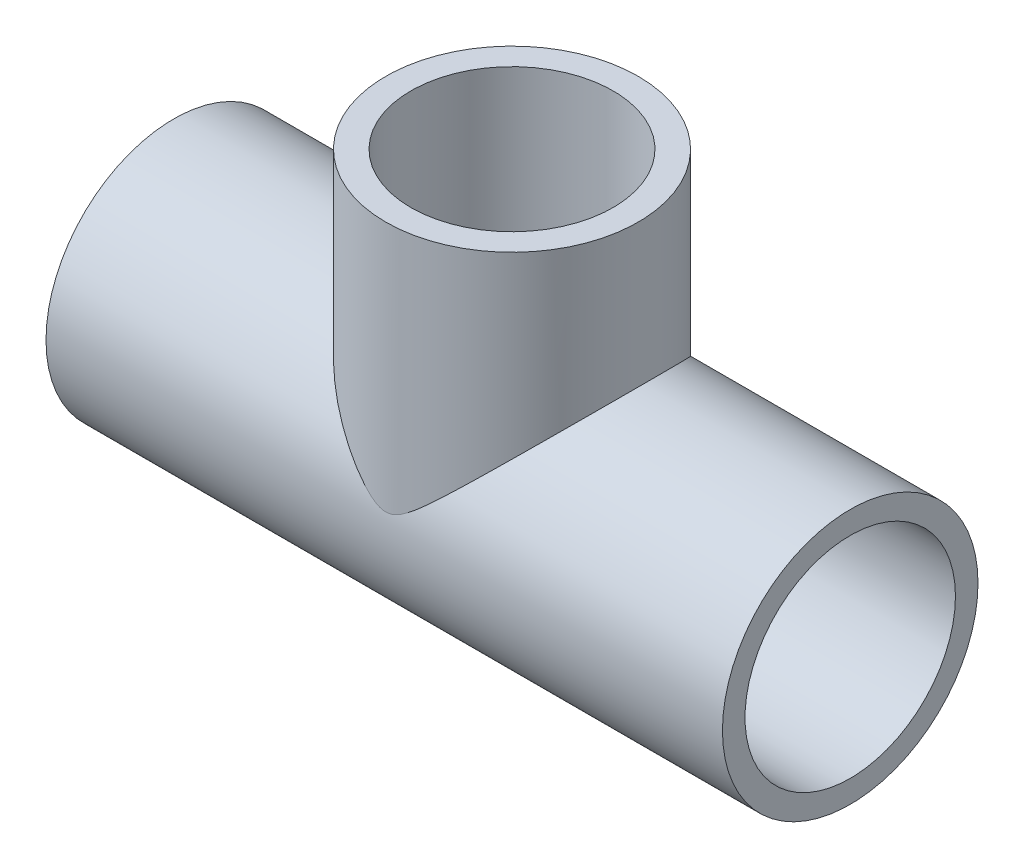
ISO-10303-21;
HEADER;
FILE_DESCRIPTION(('STEP AP214'),'2;1');
FILE_NAME('part.step','',(''),(''),'','','');
FILE_SCHEMA(('AUTOMOTIVE_DESIGN { 1 0 10303 214 1 1 1 1 }'));
ENDSEC;
DATA;
#1=APPLICATION_CONTEXT('core data for automotive mechanical design processes');
#2=APPLICATION_PROTOCOL_DEFINITION('international standard','automotive_design',2000,#1);
#3=PRODUCT_CONTEXT('',#1,'mechanical');
#4=PRODUCT('Part','Part','',(#3));
#5=PRODUCT_RELATED_PRODUCT_CATEGORY('part','',(#4));
#6=PRODUCT_DEFINITION_FORMATION('','',#4);
#7=PRODUCT_DEFINITION_CONTEXT('part definition',#1,'design');
#8=PRODUCT_DEFINITION('design','',#6,#7);
#9=PRODUCT_DEFINITION_SHAPE('','',#8);
#10=(LENGTH_UNIT() NAMED_UNIT(*) SI_UNIT(.MILLI.,.METRE.));
#11=(NAMED_UNIT(*) PLANE_ANGLE_UNIT() SI_UNIT($,.RADIAN.));
#12=(NAMED_UNIT(*) SI_UNIT($,.STERADIAN.) SOLID_ANGLE_UNIT());
#13=UNCERTAINTY_MEASURE_WITH_UNIT(LENGTH_MEASURE(1.E-05),#10,'distance_accuracy_value','');
#14=(GEOMETRIC_REPRESENTATION_CONTEXT(3) GLOBAL_UNCERTAINTY_ASSIGNED_CONTEXT((#13)) GLOBAL_UNIT_ASSIGNED_CONTEXT((#10,
#11,#12)) REPRESENTATION_CONTEXT('',''));
#15=CARTESIAN_POINT('',(0.,0.,0.));
#16=DIRECTION('',(0.,0.,1.));
#17=DIRECTION('',(1.,0.,0.));
#18=AXIS2_PLACEMENT_3D('',#15,#16,#17);
#19=CARTESIAN_POINT('',(-35.71875,0.,0.));
#20=DIRECTION('',(1.,0.,0.));
#21=DIRECTION('',(0.,0.,-1.));
#22=AXIS2_PLACEMENT_3D('',#19,#20,#21);
#23=CYLINDRICAL_SURFACE('',#22,11.1125);
#24=CARTESIAN_POINT('',(35.71875,0.,0.));
#25=DIRECTION('',(1.,0.,0.));
#26=DIRECTION('',(0.,0.,-1.));
#27=AXIS2_PLACEMENT_3D('',#24,#25,#26);
#28=CIRCLE('',#27,11.1125);
#29=CARTESIAN_POINT('',(35.71875,0.,-11.1125));
#30=VERTEX_POINT('',#29);
#31=EDGE_CURVE('E73',#30,#30,#28,.T.);
#32=ORIENTED_EDGE('',*,*,#31,.T.);
#33=EDGE_LOOP('',(#32));
#34=FACE_BOUND('',#33,.T.);
#35=CARTESIAN_POINT('',(-35.71875,0.,0.));
#36=DIRECTION('',(1.,0.,0.));
#37=DIRECTION('',(0.,0.,-1.));
#38=AXIS2_PLACEMENT_3D('',#35,#36,#37);
#39=CIRCLE('',#38,11.1125);
#40=CARTESIAN_POINT('',(-35.71875,0.,-11.1125));
#41=VERTEX_POINT('',#40);
#42=EDGE_CURVE('E76',#41,#41,#39,.T.);
#43=ORIENTED_EDGE('',*,*,#42,.F.);
#44=EDGE_LOOP('',(#43));
#45=FACE_BOUND('',#44,.T.);
#46=DIRECTION('',(1.,0.,0.));
#47=VECTOR('',#46,1.);
#48=CARTESIAN_POINT('',(-35.71875,-1.745,10.9746358140031));
#49=LINE('',#48,#47);
#50=CARTESIAN_POINT('',(7.57493193038723,-1.745,10.9746358140031));
#51=VERTEX_POINT('',#50);
#52=CARTESIAN_POINT('',(-7.57493193038723,-1.745,10.9746358140031));
#53=VERTEX_POINT('',#52);
#54=EDGE_CURVE('E38',#51,#53,#49,.F.);
#55=ORIENTED_EDGE('',*,*,#54,.F.);
#56=CARTESIAN_POINT('',(7.57493193038723,-1.745,10.9746358140031));
#57=CARTESIAN_POINT('',(7.55178237275866,-1.64451854785196,10.990613016091));
#58=CARTESIAN_POINT('',(7.53039183546734,-1.54343048441022,11.0052704939696));
#59=CARTESIAN_POINT('',(7.49137086615348,-1.34015749804955,11.0318696414961));
#60=CARTESIAN_POINT('',(7.47374118304214,-1.23797236091397,11.0438107702598));
#61=CARTESIAN_POINT('',(7.42686958040925,-0.93000687445632,11.0754362191953));
#62=CARTESIAN_POINT('',(7.40364498439078,-0.722815925060933,11.0909226860937));
#63=CARTESIAN_POINT('',(7.37488112472727,-0.30993243958338,11.1100697696276));
#64=CARTESIAN_POINT('',(7.36907165952162,-0.104266939209703,11.1139110755372));
#65=CARTESIAN_POINT('',(7.37471465754245,0.30665263608123,11.1101674213722));
#66=CARTESIAN_POINT('',(7.38616107001524,0.511906829955035,11.1025864665007));
#67=CARTESIAN_POINT('',(7.42565506604824,0.92044174908858,11.0762097745655));
#68=CARTESIAN_POINT('',(7.45373315282238,1.12371814894759,11.0573934307978));
#69=CARTESIAN_POINT('',(7.52495873844686,1.52636407050963,11.0090446441255));
#70=CARTESIAN_POINT('',(7.56811536760581,1.72573114763053,10.9795057080897));
#71=CARTESIAN_POINT('',(7.71745713968655,2.3174137536411,10.8755584029995));
#72=CARTESIAN_POINT('',(7.84338641933737,2.70218701894088,10.7858975837428));
#73=CARTESIAN_POINT('',(8.09657480913005,3.36001678378267,10.5965321273061));
#74=CARTESIAN_POINT('',(8.21664664219271,3.63816821353355,10.5040705658846));
#75=CARTESIAN_POINT('',(8.47095076250382,4.18088748029896,10.3000875031762));
#76=CARTESIAN_POINT('',(8.6051915946408,4.44544697581306,10.1885544750457));
#77=CARTESIAN_POINT('',(8.88292540614902,4.96178224058923,9.94735037149134));
#78=CARTESIAN_POINT('',(9.02643645111209,5.21353122803669,9.81764326661425));
#79=CARTESIAN_POINT('',(9.31844797045989,5.70418416661449,9.54092371498217));
#80=CARTESIAN_POINT('',(9.4669474786083,5.94309058223062,9.39391460587102));
#81=CARTESIAN_POINT('',(9.7758685839358,6.42411770048728,9.0723558304849));
#82=CARTESIAN_POINT('',(9.9364167684129,6.66536131128708,8.89661552683085));
#83=CARTESIAN_POINT('',(10.2563052887227,7.13347012704357,8.52586638410107));
#84=CARTESIAN_POINT('',(10.4156454972544,7.36033383463861,8.33085554380068));
#85=CARTESIAN_POINT('',(10.7299930091842,7.7988136656088,7.9218633747334));
#86=CARTESIAN_POINT('',(10.8850057585091,8.01044953595824,7.70790744735057));
#87=CARTESIAN_POINT('',(11.1881795309107,8.41779546538794,7.2608397007426));
#88=CARTESIAN_POINT('',(11.3363415176185,8.61350776724354,7.02773058850015));
#89=CARTESIAN_POINT('',(11.6067867411013,8.96628322956201,6.57016613448246));
#90=CARTESIAN_POINT('',(11.7300947133879,9.12520896888096,6.34775334794739));
#91=CARTESIAN_POINT('',(11.9673284064531,9.42821625455798,5.88830146910489));
#92=CARTESIAN_POINT('',(12.0812556735584,9.57230024843426,5.65126479873036));
#93=CARTESIAN_POINT('',(12.2977463072543,9.8441222486919,5.16322374429166));
#94=CARTESIAN_POINT('',(12.4003164420927,9.97186999771759,4.91222781466453));
#95=CARTESIAN_POINT('',(12.5922077928626,10.2095073743724,4.39704886932508));
#96=CARTESIAN_POINT('',(12.681531195926,10.319399950308,4.13286804018431));
#97=CARTESIAN_POINT('',(12.8324045649535,10.5042098387549,3.63436251398641));
#98=CARTESIAN_POINT('',(12.896113311797,10.581907432218,3.40171950608433));
#99=CARTESIAN_POINT('',(13.0116022824624,10.7223515859242,2.92909187138821));
#100=CARTESIAN_POINT('',(13.0633847240976,10.7851009260159,2.6891086190024));
#101=CARTESIAN_POINT('',(13.1540465584743,10.8947382809366,2.20325246693917));
#102=CARTESIAN_POINT('',(13.1929316137839,10.9416332567634,1.95738220291434));
#103=CARTESIAN_POINT('',(13.2570522880968,11.0188624892286,1.46128004864045));
#104=CARTESIAN_POINT('',(13.2822877549774,11.0491965612983,1.21104810981326));
#105=CARTESIAN_POINT('',(13.3186329439316,11.0928608642119,0.707263281749731));
#106=CARTESIAN_POINT('',(13.3296970465233,11.1061361811264,0.453702308780408));
#107=CARTESIAN_POINT('',(13.3373069185879,11.1152684881392,-0.0539529813971005));
#108=CARTESIAN_POINT('',(13.3338526717418,11.1111254586586,-0.308047299204465));
#109=CARTESIAN_POINT('',(13.3125019150525,11.0854945038913,-0.814755999049741));
#110=CARTESIAN_POINT('',(13.2946046975397,11.0640057287059,-1.06737030795998));
#111=CARTESIAN_POINT('',(13.2447547165209,11.0040554255656,-1.56916186354116));
#112=CARTESIAN_POINT('',(13.2128021200795,10.965594099349,-1.81833915102878));
#113=CARTESIAN_POINT('',(13.1373598074909,10.8745698280855,-2.29967098827321));
#114=CARTESIAN_POINT('',(13.0944956726603,10.8227701591408,-2.53206938061797));
#115=CARTESIAN_POINT('',(12.9973934507301,10.7050816386426,-2.99081229224433));
#116=CARTESIAN_POINT('',(12.9431560436531,10.6391936294443,-3.21715717256125));
#117=CARTESIAN_POINT('',(12.8241767383228,10.4941251751569,-3.66277460838364));
#118=CARTESIAN_POINT('',(12.7594317244478,10.4149407873023,-3.88204504304925));
#119=CARTESIAN_POINT('',(12.6204158752891,10.244158640912,-4.31260173542909));
#120=CARTESIAN_POINT('',(12.5461432063062,10.1525584926377,-4.52388644604448));
#121=CARTESIAN_POINT('',(12.3611513082547,9.92318487784484,-5.01140342005325));
#122=CARTESIAN_POINT('',(12.2468623106207,9.78057369243263,-5.28402031700168));
#123=CARTESIAN_POINT('',(12.0051856078049,9.4762057174178,-5.81224354976933));
#124=CARTESIAN_POINT('',(11.8777938425963,9.31444299115418,-6.06784457238759));
#125=CARTESIAN_POINT('',(11.6122836271278,8.97340720043395,-6.56169067633757));
#126=CARTESIAN_POINT('',(11.4741516980581,8.79411205784724,-6.79991319709765));
#127=CARTESIAN_POINT('',(11.1897941566567,8.41972443209385,-7.25833912299892));
#128=CARTESIAN_POINT('',(11.0435691799321,8.2246331889567,-7.47854393984719));
#129=CARTESIAN_POINT('',(10.7431603160119,7.81666701206812,-7.90415197780929));
#130=CARTESIAN_POINT('',(10.5888882666445,7.60356354278163,-8.10927331387191));
#131=CARTESIAN_POINT('',(10.2771400792841,7.16304960766284,-8.50089709671318));
#132=CARTESIAN_POINT('',(10.1196636351198,6.93563777031994,-8.68739775418427));
#133=CARTESIAN_POINT('',(9.80433096339438,6.46687265774564,-9.04176858938583));
#134=CARTESIAN_POINT('',(9.64647464800892,6.22551578581984,-9.20963392779817));
#135=CARTESIAN_POINT('',(9.33370298193822,5.72893392226707,-9.52647445109947));
#136=CARTESIAN_POINT('',(9.17878705658089,5.47371167895452,-9.67545336017365));
#137=CARTESIAN_POINT('',(8.9096208161552,5.00743948060842,-9.92302833232026));
#138=CARTESIAN_POINT('',(8.79399770054061,4.79921098915026,-10.0254558166122));
#139=CARTESIAN_POINT('',(8.56924162185898,4.37378223883757,-10.2182301185517));
#140=CARTESIAN_POINT('',(8.46010898447514,4.15658153069476,-10.3085763302612));
#141=CARTESIAN_POINT('',(8.25140236806852,3.7133826906549,-10.4763770828761));
#142=CARTESIAN_POINT('',(8.15180884231155,3.48740394301277,-10.5538582357548));
#143=CARTESIAN_POINT('',(7.96539284118948,3.02611393416045,-10.6952525668634));
#144=CARTESIAN_POINT('',(7.87856552278485,2.79080625524702,-10.7591708944405));
#145=CARTESIAN_POINT('',(7.74287140072565,2.3758913318316,-10.8570331485492));
#146=CARTESIAN_POINT('',(7.69008216448691,2.19837642721352,-10.8944119425081));
#147=CARTESIAN_POINT('',(7.59516268160343,1.83900329379136,-10.9607977339476));
#148=CARTESIAN_POINT('',(7.55302896608666,1.65714649963033,-10.9898074563876));
#149=CARTESIAN_POINT('',(7.48108385774343,1.29010196995046,-11.0389090648338));
#150=CARTESIAN_POINT('',(7.45125293006401,1.10492000606068,-11.0590150922532));
#151=CARTESIAN_POINT('',(7.40515862847757,0.732112764157108,-11.0899337678688));
#152=CARTESIAN_POINT('',(7.38889261570895,0.544487968577674,-11.1007482236208));
#153=CARTESIAN_POINT('',(7.37131011955313,0.180395739921563,-11.112430654494));
#154=CARTESIAN_POINT('',(7.36909573663663,0.00399057087149848,-11.1138960688291));
#155=CARTESIAN_POINT('',(7.37732478829709,-0.348436947852183,-11.1084346302195));
#156=CARTESIAN_POINT('',(7.38777118077797,-0.524459198439249,-11.1015058161534));
#157=CARTESIAN_POINT('',(7.42102455394145,-0.876311114345856,-11.079307274873));
#158=CARTESIAN_POINT('',(7.44393728017486,-1.05212604737472,-11.0639661817199));
#159=CARTESIAN_POINT('',(7.50115281580773,-1.40092159349763,-11.025243449798));
#160=CARTESIAN_POINT('',(7.53545032309729,-1.57390348671436,-11.0018655537413));
#161=CARTESIAN_POINT('',(7.57493193038773,-1.74500000000003,-10.9746358140031));
#162=B_SPLINE_CURVE_WITH_KNOTS('',3,(#56,#57,#58,#59,#60,#61,#62,#63,#64,#65,#66,#67,#68,#69,
#70,#71,#72,#73,#74,#75,#76,#77,#78,#79,#80,#81,#82,#83,#84,#85,#86,#87,#88,#89,#90,#91,#92,#93,
#94,#95,#96,#97,#98,#99,#100,#101,#102,#103,#104,#105,#106,#107,#108,#109,#110,#111,#112,#113,
#114,#115,#116,#117,#118,#119,#120,#121,#122,#123,#124,#125,#126,#127,#128,#129,#130,#131,#132,
#133,#134,#135,#136,#137,#138,#139,#140,#141,#142,#143,#144,#145,#146,#147,#148,#149,#150,#151,
#152,#153,#154,#155,#156,#157,#158,#159,#160,#161),.UNSPECIFIED.,.F.,.F.,(4,2,2,2,2,2,2,2,2,2,2,
2,2,2,2,2,2,2,2,2,2,2,2,2,2,2,2,2,2,2,2,2,2,2,2,2,2,2,2,2,2,2,2,2,2,2,2,2,2,2,2,2,4),(0.,
0.312985757035545,0.62603378188948,1.25212820065715,1.86845693766926,2.48456960997926,
3.10181577378743,3.71943634002768,4.95803217255051,5.90719324112796,6.85693002604756,
7.80857699435102,8.76004068512438,9.775909377729,10.7918836783033,11.8065158211999,
12.8210048086539,13.7198511936178,14.6185491137811,15.5167085418938,16.4147195118348,
17.1741892258435,17.9335175947891,18.6925121396689,19.4515151432562,20.2129553864762,
20.9743964855838,21.7358748956819,22.4973442549716,23.222357962966,23.9473283338158,
24.6725140604725,25.3978395668828,26.3810353598608,27.3645367292139,28.3492929494893,
29.3339719389918,30.3338932391472,31.3339105319507,32.3341869100386,33.3342657373842,
34.1116153409647,34.889003918019,35.6647638377495,36.4402286985193,37.0065624899928,
37.5727116752196,38.1379584128187,38.703095164023,39.2317222950164,39.7604729515976,
40.2937802882002,40.8268396010502),.UNSPECIFIED.);
#163=CARTESIAN_POINT('',(7.57493193038723,-1.745,-10.9746358140031));
#164=VERTEX_POINT('',#163);
#165=EDGE_CURVE('E58',#51,#164,#162,.T.);
#166=ORIENTED_EDGE('',*,*,#165,.T.);
#167=DIRECTION('',(1.,0.,0.));
#168=VECTOR('',#167,1.);
#169=CARTESIAN_POINT('',(-35.71875,-1.745,-10.9746358140031));
#170=LINE('',#169,#168);
#171=CARTESIAN_POINT('',(-7.57493193038723,-1.745,-10.9746358140031));
#172=VERTEX_POINT('',#171);
#173=EDGE_CURVE('E60',#172,#164,#170,.T.);
#174=ORIENTED_EDGE('',*,*,#173,.F.);
#175=CARTESIAN_POINT('',(-7.57493193038723,-1.745,-10.9746358140031));
#176=CARTESIAN_POINT('',(-7.55178237275866,-1.64451854785196,-10.990613016091));
#177=CARTESIAN_POINT('',(-7.53039183546734,-1.54343048441022,-11.0052704939696));
#178=CARTESIAN_POINT('',(-7.49137086615348,-1.34015749804955,-11.0318696414961));
#179=CARTESIAN_POINT('',(-7.47374118304214,-1.23797236091397,-11.0438107702598));
#180=CARTESIAN_POINT('',(-7.42686958040925,-0.93000687445632,-11.0754362191953));
#181=CARTESIAN_POINT('',(-7.40364498439078,-0.722815925060933,-11.0909226860937));
#182=CARTESIAN_POINT('',(-7.37488112472727,-0.30993243958338,-11.1100697696276));
#183=CARTESIAN_POINT('',(-7.36907165952162,-0.104266939209703,-11.1139110755372));
#184=CARTESIAN_POINT('',(-7.37471465754245,0.30665263608123,-11.1101674213722));
#185=CARTESIAN_POINT('',(-7.38616107001524,0.511906829955035,-11.1025864665007));
#186=CARTESIAN_POINT('',(-7.42565506604824,0.92044174908858,-11.0762097745655));
#187=CARTESIAN_POINT('',(-7.45373315282238,1.12371814894759,-11.0573934307978));
#188=CARTESIAN_POINT('',(-7.52495873844686,1.52636407050963,-11.0090446441255));
#189=CARTESIAN_POINT('',(-7.56811536760581,1.72573114763053,-10.9795057080897));
#190=CARTESIAN_POINT('',(-7.71745713968655,2.3174137536411,-10.8755584029995));
#191=CARTESIAN_POINT('',(-7.84338641933737,2.70218701894088,-10.7858975837428));
#192=CARTESIAN_POINT('',(-8.09657480913005,3.36001678378267,-10.5965321273061));
#193=CARTESIAN_POINT('',(-8.21664664219271,3.63816821353355,-10.5040705658846));
#194=CARTESIAN_POINT('',(-8.47095076250382,4.18088748029896,-10.3000875031762));
#195=CARTESIAN_POINT('',(-8.6051915946408,4.44544697581306,-10.1885544750457));
#196=CARTESIAN_POINT('',(-8.88292540614902,4.96178224058923,-9.94735037149134));
#197=CARTESIAN_POINT('',(-9.02643645111209,5.21353122803669,-9.81764326661425));
#198=CARTESIAN_POINT('',(-9.31844797045989,5.70418416661449,-9.54092371498217));
#199=CARTESIAN_POINT('',(-9.4669474786083,5.94309058223062,-9.39391460587102));
#200=CARTESIAN_POINT('',(-9.7758685839358,6.42411770048728,-9.0723558304849));
#201=CARTESIAN_POINT('',(-9.9364167684129,6.66536131128708,-8.89661552683085));
#202=CARTESIAN_POINT('',(-10.2563052887227,7.13347012704357,-8.52586638410107));
#203=CARTESIAN_POINT('',(-10.4156454972544,7.36033383463861,-8.33085554380068));
#204=CARTESIAN_POINT('',(-10.7299930091842,7.7988136656088,-7.9218633747334));
#205=CARTESIAN_POINT('',(-10.8850057585091,8.01044953595824,-7.70790744735057));
#206=CARTESIAN_POINT('',(-11.1881795309107,8.41779546538794,-7.2608397007426));
#207=CARTESIAN_POINT('',(-11.3363415176185,8.61350776724354,-7.02773058850015));
#208=CARTESIAN_POINT('',(-11.6067867411013,8.96628322956201,-6.57016613448246));
#209=CARTESIAN_POINT('',(-11.7300947133879,9.12520896888096,-6.34775334794739));
#210=CARTESIAN_POINT('',(-11.9673284064531,9.42821625455798,-5.88830146910489));
#211=CARTESIAN_POINT('',(-12.0812556735584,9.57230024843426,-5.65126479873036));
#212=CARTESIAN_POINT('',(-12.2977463072543,9.8441222486919,-5.16322374429166));
#213=CARTESIAN_POINT('',(-12.4003164420927,9.97186999771759,-4.91222781466453));
#214=CARTESIAN_POINT('',(-12.5922077928626,10.2095073743724,-4.39704886932508));
#215=CARTESIAN_POINT('',(-12.681531195926,10.319399950308,-4.13286804018431));
#216=CARTESIAN_POINT('',(-12.8324045649535,10.5042098387549,-3.63436251398641));
#217=CARTESIAN_POINT('',(-12.896113311797,10.581907432218,-3.40171950608433));
#218=CARTESIAN_POINT('',(-13.0116022824624,10.7223515859242,-2.92909187138821));
#219=CARTESIAN_POINT('',(-13.0633847240976,10.7851009260159,-2.6891086190024));
#220=CARTESIAN_POINT('',(-13.1540465584743,10.8947382809366,-2.20325246693917));
#221=CARTESIAN_POINT('',(-13.1929316137839,10.9416332567634,-1.95738220291434));
#222=CARTESIAN_POINT('',(-13.2570522880968,11.0188624892286,-1.46128004864045));
#223=CARTESIAN_POINT('',(-13.2822877549774,11.0491965612983,-1.21104810981326));
#224=CARTESIAN_POINT('',(-13.3186329439316,11.0928608642119,-0.707263281749731));
#225=CARTESIAN_POINT('',(-13.3296970465233,11.1061361811264,-0.453702308780408));
#226=CARTESIAN_POINT('',(-13.3373069185879,11.1152684881392,0.0539529813971005));
#227=CARTESIAN_POINT('',(-13.3338526717418,11.1111254586586,0.308047299204465));
#228=CARTESIAN_POINT('',(-13.3125019150525,11.0854945038913,0.814755999049741));
#229=CARTESIAN_POINT('',(-13.2946046975397,11.0640057287059,1.06737030795998));
#230=CARTESIAN_POINT('',(-13.2447547165209,11.0040554255656,1.56916186354116));
#231=CARTESIAN_POINT('',(-13.2128021200795,10.965594099349,1.81833915102878));
#232=CARTESIAN_POINT('',(-13.1373598074909,10.8745698280855,2.29967098827321));
#233=CARTESIAN_POINT('',(-13.0944956726603,10.8227701591408,2.53206938061797));
#234=CARTESIAN_POINT('',(-12.9973934507301,10.7050816386426,2.99081229224433));
#235=CARTESIAN_POINT('',(-12.9431560436531,10.6391936294443,3.21715717256125));
#236=CARTESIAN_POINT('',(-12.8241767383228,10.4941251751569,3.66277460838364));
#237=CARTESIAN_POINT('',(-12.7594317244478,10.4149407873023,3.88204504304925));
#238=CARTESIAN_POINT('',(-12.6204158752891,10.244158640912,4.31260173542909));
#239=CARTESIAN_POINT('',(-12.5461432063062,10.1525584926377,4.52388644604448));
#240=CARTESIAN_POINT('',(-12.3611513082547,9.92318487784484,5.01140342005325));
#241=CARTESIAN_POINT('',(-12.2468623106207,9.78057369243263,5.28402031700168));
#242=CARTESIAN_POINT('',(-12.0051856078049,9.4762057174178,5.81224354976933));
#243=CARTESIAN_POINT('',(-11.8777938425963,9.31444299115418,6.06784457238759));
#244=CARTESIAN_POINT('',(-11.6122836271278,8.97340720043395,6.56169067633757));
#245=CARTESIAN_POINT('',(-11.4741516980581,8.79411205784724,6.79991319709765));
#246=CARTESIAN_POINT('',(-11.1897941566567,8.41972443209385,7.25833912299892));
#247=CARTESIAN_POINT('',(-11.0435691799321,8.2246331889567,7.47854393984719));
#248=CARTESIAN_POINT('',(-10.7431603160119,7.81666701206812,7.90415197780929));
#249=CARTESIAN_POINT('',(-10.5888882666445,7.60356354278163,8.10927331387191));
#250=CARTESIAN_POINT('',(-10.2771400792841,7.16304960766284,8.50089709671318));
#251=CARTESIAN_POINT('',(-10.1196636351198,6.93563777031994,8.68739775418427));
#252=CARTESIAN_POINT('',(-9.80433096339438,6.46687265774564,9.04176858938583));
#253=CARTESIAN_POINT('',(-9.64647464800892,6.22551578581984,9.20963392779817));
#254=CARTESIAN_POINT('',(-9.33370298193822,5.72893392226707,9.52647445109947));
#255=CARTESIAN_POINT('',(-9.17878705658089,5.47371167895452,9.67545336017365));
#256=CARTESIAN_POINT('',(-8.9096208161552,5.00743948060842,9.92302833232026));
#257=CARTESIAN_POINT('',(-8.79399770054061,4.79921098915026,10.0254558166122));
#258=CARTESIAN_POINT('',(-8.56924162185898,4.37378223883757,10.2182301185517));
#259=CARTESIAN_POINT('',(-8.46010898447514,4.15658153069476,10.3085763302612));
#260=CARTESIAN_POINT('',(-8.25140236806852,3.7133826906549,10.4763770828761));
#261=CARTESIAN_POINT('',(-8.15180884231155,3.48740394301277,10.5538582357548));
#262=CARTESIAN_POINT('',(-7.96539284118948,3.02611393416045,10.6952525668634));
#263=CARTESIAN_POINT('',(-7.87856552278485,2.79080625524702,10.7591708944405));
#264=CARTESIAN_POINT('',(-7.74287140072565,2.3758913318316,10.8570331485492));
#265=CARTESIAN_POINT('',(-7.69008216448691,2.19837642721352,10.8944119425081));
#266=CARTESIAN_POINT('',(-7.59516268160343,1.83900329379136,10.9607977339476));
#267=CARTESIAN_POINT('',(-7.55302896608666,1.65714649963033,10.9898074563876));
#268=CARTESIAN_POINT('',(-7.48108385774343,1.29010196995046,11.0389090648338));
#269=CARTESIAN_POINT('',(-7.45125293006401,1.10492000606068,11.0590150922532));
#270=CARTESIAN_POINT('',(-7.40515862847757,0.732112764157108,11.0899337678688));
#271=CARTESIAN_POINT('',(-7.38889261570895,0.544487968577674,11.1007482236208));
#272=CARTESIAN_POINT('',(-7.37131011955313,0.180395739921563,11.112430654494));
#273=CARTESIAN_POINT('',(-7.36909573663663,0.00399057087149848,11.1138960688291));
#274=CARTESIAN_POINT('',(-7.37732478829709,-0.348436947852183,11.1084346302195));
#275=CARTESIAN_POINT('',(-7.38777118077797,-0.524459198439249,11.1015058161534));
#276=CARTESIAN_POINT('',(-7.42102455394145,-0.876311114345856,11.079307274873));
#277=CARTESIAN_POINT('',(-7.44393728017486,-1.05212604737472,11.0639661817199));
#278=CARTESIAN_POINT('',(-7.50115281580773,-1.40092159349763,11.025243449798));
#279=CARTESIAN_POINT('',(-7.53545032309729,-1.57390348671436,11.0018655537413));
#280=CARTESIAN_POINT('',(-7.57493193038773,-1.74500000000003,10.9746358140031));
#281=B_SPLINE_CURVE_WITH_KNOTS('',3,(#175,#176,#177,#178,#179,#180,#181,#182,#183,#184,#185,
#186,#187,#188,#189,#190,#191,#192,#193,#194,#195,#196,#197,#198,#199,#200,#201,#202,#203,#204,
#205,#206,#207,#208,#209,#210,#211,#212,#213,#214,#215,#216,#217,#218,#219,#220,#221,#222,#223,
#224,#225,#226,#227,#228,#229,#230,#231,#232,#233,#234,#235,#236,#237,#238,#239,#240,#241,#242,
#243,#244,#245,#246,#247,#248,#249,#250,#251,#252,#253,#254,#255,#256,#257,#258,#259,#260,#261,
#262,#263,#264,#265,#266,#267,#268,#269,#270,#271,#272,#273,#274,#275,#276,#277,#278,#279,#280),
.UNSPECIFIED.,.F.,.F.,(4,2,2,2,2,2,2,2,2,2,2,2,2,2,2,2,2,2,2,2,2,2,2,2,2,2,2,2,2,2,2,2,2,2,2,2,
2,2,2,2,2,2,2,2,2,2,2,2,2,2,2,2,4),(0.,0.312985757035545,0.62603378188948,1.25212820065715,
1.86845693766926,2.48456960997926,3.10181577378743,3.71943634002768,4.95803217255051,
5.90719324112796,6.85693002604756,7.80857699435102,8.76004068512438,9.775909377729,
10.7918836783033,11.8065158211999,12.8210048086539,13.7198511936178,14.6185491137811,
15.5167085418938,16.4147195118348,17.1741892258435,17.9335175947891,18.6925121396689,
19.4515151432562,20.2129553864762,20.9743964855838,21.7358748956819,22.4973442549716,
23.222357962966,23.9473283338158,24.6725140604725,25.3978395668828,26.3810353598608,
27.3645367292139,28.3492929494893,29.3339719389918,30.3338932391472,31.3339105319507,
32.3341869100386,33.3342657373842,34.1116153409647,34.889003918019,35.6647638377495,
36.4402286985193,37.0065624899928,37.5727116752196,38.1379584128187,38.703095164023,
39.2317222950164,39.7604729515976,40.2937802882002,40.8268396010502),.UNSPECIFIED.);
#282=EDGE_CURVE('E54',#172,#53,#281,.T.);
#283=ORIENTED_EDGE('',*,*,#282,.T.);
#284=EDGE_LOOP('',(#55,#166,#174,#283));
#285=FACE_BOUND('',#284,.T.);
#286=ADVANCED_FACE('F33',(#34,#45,#285),#23,.F.);
#287=CARTESIAN_POINT('',(-35.71875,0.,0.));
#288=DIRECTION('',(1.,0.,0.));
#289=DIRECTION('',(0.,0.,-1.));
#290=AXIS2_PLACEMENT_3D('',#287,#288,#289);
#291=CYLINDRICAL_SURFACE('',#290,13.49375);
#292=CARTESIAN_POINT('',(0.,2.06374999999999,13.335));
#293=CARTESIAN_POINT('',(0.13714645873907,2.06382052588272,13.3349930472285));
#294=CARTESIAN_POINT('',(0.274496566088781,2.07780036666839,13.3328483541032));
#295=CARTESIAN_POINT('',(0.544510792270477,2.1301713794063,13.324573296404));
#296=CARTESIAN_POINT('',(0.677151109754187,2.16867184467675,13.3184250845838));
#297=CARTESIAN_POINT('',(0.943361028994935,2.26554289198876,13.3022980728514));
#298=CARTESIAN_POINT('',(1.07652230670548,2.32495327878856,13.2921143687011));
#299=CARTESIAN_POINT('',(1.33642999140954,2.45611302180289,13.2685061310035));
#300=CARTESIAN_POINT('',(1.46316312073456,2.52788667070769,13.2550751955649));
#301=CARTESIAN_POINT('',(1.71236245593989,2.67982095018138,13.2251993131329));
#302=CARTESIAN_POINT('',(1.83478943199336,2.76004056331755,13.2087324713437));
#303=CARTESIAN_POINT('',(2.07550314976066,2.92561192581442,13.1730512435087));
#304=CARTESIAN_POINT('',(2.19379336196067,3.01095920162866,13.1538392328349));
#305=CARTESIAN_POINT('',(2.53389306527214,3.26454747660535,13.094012267336));
#306=CARTESIAN_POINT('',(2.75165967038157,3.43735812612651,13.049865238289));
#307=CARTESIAN_POINT('',(3.18007002217985,3.78909838565521,12.9521247379187));
#308=CARTESIAN_POINT('',(3.39071007500071,3.96803107508121,12.8985264545442));
#309=CARTESIAN_POINT('',(3.80708098087026,4.32922463416811,12.7818299297321));
#310=CARTESIAN_POINT('',(4.01280300736019,4.51149058266998,12.7187159052083));
#311=CARTESIAN_POINT('',(4.41993121823355,4.87718678579456,12.5830210611523));
#312=CARTESIAN_POINT('',(4.62133830204827,5.06061678723634,12.5104422373166));
#313=CARTESIAN_POINT('',(5.21959337290027,5.61054415989713,12.2784824317002));
#314=CARTESIAN_POINT('',(5.61094632041999,5.9770964410456,12.1047456176758));
#315=CARTESIAN_POINT('',(6.379337879212,6.70372256531404,11.7179743206225));
#316=CARTESIAN_POINT('',(6.75638755724952,7.0638012987904,11.5049709989332));
#317=CARTESIAN_POINT('',(7.49774273873258,7.77589162452422,11.0362951565015));
#318=CARTESIAN_POINT('',(7.86193386142107,8.12782422111388,10.7803197852359));
#319=CARTESIAN_POINT('',(8.57182755000004,8.81634204456464,10.2249268417095));
#320=CARTESIAN_POINT('',(8.91752194398258,9.15292047838855,9.92549028156048));
#321=CARTESIAN_POINT('',(9.58489783750544,9.80428907039042,9.28256438697386));
#322=CARTESIAN_POINT('',(9.90665241646918,10.1191453046091,8.93921861978559));
#323=CARTESIAN_POINT('',(10.5215696214352,10.7218842249452,8.20652851960835));
#324=CARTESIAN_POINT('',(10.8147580904233,11.0097912818087,7.81722648072975));
#325=CARTESIAN_POINT('',(11.2485560842963,11.4362689138335,7.16754311232782));
#326=CARTESIAN_POINT('',(11.4011084759905,11.5863575683313,6.92257525317929));
#327=CARTESIAN_POINT('',(11.6928266191561,11.8735250918618,6.41755450079205));
#328=CARTESIAN_POINT('',(11.8319967934751,12.0106082590306,6.15750663738933));
#329=CARTESIAN_POINT('',(12.0952215034603,12.2700019408543,5.62286367002114));
#330=CARTESIAN_POINT('',(12.2192800879893,12.3923164124228,5.3482724910759));
#331=CARTESIAN_POINT('',(12.4505049039427,12.6203713239687,4.785364982731));
#332=CARTESIAN_POINT('',(12.5576704845752,12.7261111254168,4.49704812511539));
#333=CARTESIAN_POINT('',(12.7542327032254,12.9201108032228,3.90512220763984));
#334=CARTESIAN_POINT('',(12.8434398836206,13.0081842714804,3.60138855529438));
#335=CARTESIAN_POINT('',(13.0009074005069,13.1636812102266,2.98333721406728));
#336=CARTESIAN_POINT('',(13.0691677308909,13.2311046746947,2.66901952209988));
#337=CARTESIAN_POINT('',(13.1831264735768,13.3436805031385,2.03267688537111));
#338=CARTESIAN_POINT('',(13.2288454146781,13.3888531312667,1.7106592344165));
#339=CARTESIAN_POINT('',(13.2966633915732,13.4558646672244,1.06175534272524));
#340=CARTESIAN_POINT('',(13.3187663103102,13.4777074109502,0.734869911312794));
#341=CARTESIAN_POINT('',(13.3373895532953,13.4961114035192,0.12556073279356));
#342=CARTESIAN_POINT('',(13.3370580664047,13.4957837885588,-0.156681077042596));
#343=CARTESIAN_POINT('',(13.3185297749511,13.4774736976676,-0.719981250887246));
#344=CARTESIAN_POINT('',(13.3003349237284,13.4594931520665,-1.00103974091583));
#345=CARTESIAN_POINT('',(13.2464353509382,13.4062334947854,-1.5597976229999));
#346=CARTESIAN_POINT('',(13.2107308642807,13.3709546151806,-1.83749706006936));
#347=CARTESIAN_POINT('',(13.1224780923589,13.2837663588616,-2.38754803393884));
#348=CARTESIAN_POINT('',(13.0699293678894,13.2318565485042,-2.65989943109482));
#349=CARTESIAN_POINT('',(12.9512525554753,13.1146453975397,-3.18707447305627));
#350=CARTESIAN_POINT('',(12.8857294882172,13.0499408408531,-3.44216838281891));
#351=CARTESIAN_POINT('',(12.7409054759957,12.9069595102872,-3.94460902185389));
#352=CARTESIAN_POINT('',(12.6615993841339,12.828677666359,-4.19195281618529));
#353=CARTESIAN_POINT('',(12.4902806621005,12.6596201603994,-4.67776139264487));
#354=CARTESIAN_POINT('',(12.3982692000328,12.5688456469191,-4.91622698845913));
#355=CARTESIAN_POINT('',(12.2025999713522,12.3758736386877,-5.38358543822256));
#356=CARTESIAN_POINT('',(12.0989397785265,12.2736737642706,-5.61247628425678));
#357=CARTESIAN_POINT('',(11.8327783579829,12.0113693894222,-6.15926480524008));
#358=CARTESIAN_POINT('',(11.6645433052863,11.8456594203266,-6.47170896992225));
#359=CARTESIAN_POINT('',(11.3090310253278,11.4957495725769,-7.07464782978413));
#360=CARTESIAN_POINT('',(11.1217470825373,11.311543173454,-7.36513472075712));
#361=CARTESIAN_POINT('',(10.7304486489866,10.9270429893988,-7.92441864707513));
#362=CARTESIAN_POINT('',(10.526399994995,10.7267163725724,-8.19316906097648));
#363=CARTESIAN_POINT('',(10.1042882813893,10.3128072676637,-8.7084167002227));
#364=CARTESIAN_POINT('',(9.88622515579823,10.0992247171754,-8.95491382079082));
#365=CARTESIAN_POINT('',(9.35282508071583,9.57758852405684,-9.515688409639));
#366=CARTESIAN_POINT('',(9.03202577165804,9.26449044703646,-9.82010486552581));
#367=CARTESIAN_POINT('',(8.37166766516889,8.62195138634789,-10.3888128407842));
#368=CARTESIAN_POINT('',(8.03210023673941,8.29250289075135,-10.6530856861394));
#369=CARTESIAN_POINT('',(7.33751249292002,7.62168108834963,-11.1428750533709));
#370=CARTESIAN_POINT('',(6.982496524033,7.28031114095774,-11.3684023892006));
#371=CARTESIAN_POINT('',(6.2590962920816,6.58965773822976,-11.7821725420013));
#372=CARTESIAN_POINT('',(5.89071750564562,6.24037754639918,-11.9704304337238));
#373=CARTESIAN_POINT('',(5.20487426064253,5.59803011247461,-12.2820265212295));
#374=CARTESIAN_POINT('',(4.88941456215908,5.30551268810069,-12.4109605777451));
#375=CARTESIAN_POINT('',(4.24918816546594,4.72196542180949,-12.6444747580738));
#376=CARTESIAN_POINT('',(3.92443669034264,4.43093397469529,-12.7490924123425));
#377=CARTESIAN_POINT('',(3.35253515729664,3.93498527245261,-12.9091117655559));
#378=CARTESIAN_POINT('',(3.10849464176706,3.72831583774498,-12.9701450649635));
#379=CARTESIAN_POINT('',(2.73444599445079,3.42505608299938,-13.0522536876278));
#380=CARTESIAN_POINT('',(2.60829705041606,3.32499347888243,-13.0780714948474));
#381=CARTESIAN_POINT('',(2.3526359366764,3.12846391745113,-13.1264709344692));
#382=CARTESIAN_POINT('',(2.22312441892738,3.03199627182831,-13.1490531887462));
#383=CARTESIAN_POINT('',(1.90233228653841,2.80357109096306,-13.2000073891538));
#384=CARTESIAN_POINT('',(1.70872434427518,2.674463226125,-13.226615090789));
#385=CARTESIAN_POINT('',(1.30765969479389,2.43776037287945,-13.2722589932467));
#386=CARTESIAN_POINT('',(1.10024717683667,2.33010076512478,-13.2913181133103));
#387=CARTESIAN_POINT('',(0.762675936398141,2.19742628932843,-13.3137170975777));
#388=CARTESIAN_POINT('',(0.639059312660913,2.15693521990144,-13.3202795846286));
#389=CARTESIAN_POINT('',(0.387014508197854,2.09619103691555,-13.329975069895));
#390=CARTESIAN_POINT('',(0.258606075653555,2.0758627168671,-13.3331208166639));
#391=CARTESIAN_POINT('',(-0.000971640129490703,2.05967015844834,-13.3356347736607));
#392=CARTESIAN_POINT('',(-0.132154982897279,2.06401000008712,-13.3349714711117));
#393=CARTESIAN_POINT('',(-0.391531968349919,2.09657933018149,-13.329886534755));
#394=CARTESIAN_POINT('',(-0.519717465105821,2.12486754381759,-13.3254556621547));
#395=CARTESIAN_POINT('',(-0.83437616567381,2.21861999384601,-13.3102259052882));
#396=CARTESIAN_POINT('',(-1.01713889317582,2.29569720576298,-13.2973293654746));
#397=CARTESIAN_POINT('',(-1.28206768045189,2.42836110068947,-13.2735245854704));
#398=CARTESIAN_POINT('',(-1.36908750177549,2.47559066573947,-13.264813553933));
#399=CARTESIAN_POINT('',(-1.54050048189859,2.57435571808263,-13.2459992924913));
#400=CARTESIAN_POINT('',(-1.62489452832056,2.62588972810144,-13.2358965394556));
#401=CARTESIAN_POINT('',(-1.87679940011799,2.78647149414622,-13.2033644228181));
#402=CARTESIAN_POINT('',(-2.04091934434253,2.90037124052372,-13.178906943214));
#403=CARTESIAN_POINT('',(-2.36305107104557,3.13545611553636,-13.1249700429113));
#404=CARTESIAN_POINT('',(-2.52105837737154,3.25664642296395,-13.0954870244418));
#405=CARTESIAN_POINT('',(-2.83292058280938,3.50363071259897,-13.0315834077984));
#406=CARTESIAN_POINT('',(-2.98676647804436,3.62943347505308,-12.9971529849076));
#407=CARTESIAN_POINT('',(-3.29106145478145,3.88371365772024,-12.9234522641366));
#408=CARTESIAN_POINT('',(-3.44151007968774,4.01219143304939,-12.8841813202136));
#409=CARTESIAN_POINT('',(-3.88978973862758,4.4007934526154,-12.7588562359369));
#410=CARTESIAN_POINT('',(-4.18356514672044,4.66327853501591,-12.6654948634814));
#411=CARTESIAN_POINT('',(-4.76263270654615,5.18916843870057,-12.4592826379111));
#412=CARTESIAN_POINT('',(-5.04793376544074,5.45257194381324,-12.3464531629748));
#413=CARTESIAN_POINT('',(-5.7445704607659,6.10216301986678,-12.042724678329));
#414=CARTESIAN_POINT('',(-6.15169136371073,6.4874973578158,-11.8401417986361));
#415=CARTESIAN_POINT('',(-6.95000113720643,7.24897246551303,-11.3898937900269));
#416=CARTESIAN_POINT('',(-7.34117818955109,7.62510633580909,-11.142195937977));
#417=CARTESIAN_POINT('',(-8.10338158941043,8.36147187509583,-10.6007218803226));
#418=CARTESIAN_POINT('',(-8.47446800147741,8.7217502643796,-10.3070945496709));
#419=CARTESIAN_POINT('',(-9.19338547946624,9.42182443145506,-9.67129011418474));
#420=CARTESIAN_POINT('',(-9.54123456723694,9.76163606175769,-9.32915129121703));
#421=CARTESIAN_POINT('',(-10.0798755243999,10.2888877715197,-8.73565484460226));
#422=CARTESIAN_POINT('',(-10.2796959761612,10.4847421591736,-8.49987040549169));
#423=CARTESIAN_POINT('',(-10.6666454311105,10.8643907178663,-8.00890549262058));
#424=CARTESIAN_POINT('',(-10.8537755252805,11.0481859255812,-7.75372669019146));
#425=CARTESIAN_POINT('',(-11.2132044936792,11.4014880899176,-7.22416678392222));
#426=CARTESIAN_POINT('',(-11.3855165196839,11.5710077140022,-6.9498031081546));
#427=CARTESIAN_POINT('',(-11.7132488392769,11.8936298787348,-6.38196117526923));
#428=CARTESIAN_POINT('',(-11.8686718513211,12.0467350613983,-6.08848600653588));
#429=CARTESIAN_POINT('',(-12.1347635971703,12.3089860465435,-5.5359453665378));
#430=CARTESIAN_POINT('',(-12.2485122830634,12.421143665663,-5.27979020744996));
#431=CARTESIAN_POINT('',(-12.4613328855524,12.6310559285252,-4.75576915699955));
#432=CARTESIAN_POINT('',(-12.5604079074183,12.7288136195854,-4.48790575894192));
#433=CARTESIAN_POINT('',(-12.7423911088667,12.9084228605901,-3.94164120214904));
#434=CARTESIAN_POINT('',(-12.825304857996,12.9902798902352,-3.66324371334038));
#435=CARTESIAN_POINT('',(-12.9735977752207,13.1367106239477,-3.09734227619125));
#436=CARTESIAN_POINT('',(-13.0389768094397,13.201284196057,-2.80983825834172));
#437=CARTESIAN_POINT('',(-13.1513365951115,13.3122740802993,-2.22567439280904));
#438=CARTESIAN_POINT('',(-13.1981885823069,13.3585633126417,-1.92896540788698));
#439=CARTESIAN_POINT('',(-13.2718662009118,13.4313612202234,-1.33065109922817));
#440=CARTESIAN_POINT('',(-13.2986917531498,13.457869817263,-1.02904575613924));
#441=CARTESIAN_POINT('',(-13.3317119935054,13.4905004480074,-0.423708985128769));
#442=CARTESIAN_POINT('',(-13.3379138390364,13.4966295543709,-0.11997833147109));
#443=CARTESIAN_POINT('',(-13.3295620000073,13.4883759834458,0.486901180470933));
#444=CARTESIAN_POINT('',(-13.3150100596429,13.4739950298696,0.790050085502783));
#445=CARTESIAN_POINT('',(-13.2682307590625,13.4277697523682,1.35967407187219));
#446=CARTESIAN_POINT('',(-13.2381336740817,13.3980301908922,1.62650087254492));
#447=CARTESIAN_POINT('',(-13.1623179263836,13.3231243679685,2.15570156694289));
#448=CARTESIAN_POINT('',(-13.1166006743118,13.2779594995687,2.4180758605255));
#449=CARTESIAN_POINT('',(-13.0102855743209,13.172946747855,2.93680181845357));
#450=CARTESIAN_POINT('',(-12.949686600843,13.1130977539273,3.19315302564341));
#451=CARTESIAN_POINT('',(-12.8145211101289,12.9796340927789,3.69847240151042));
#452=CARTESIAN_POINT('',(-12.7399537443895,12.9060185893186,3.94744012061638));
#453=CARTESIAN_POINT('',(-12.5741302965422,12.7423557584479,4.44816517470749));
#454=CARTESIAN_POINT('',(-12.4822644507744,12.6517084680013,4.69952428794134));
#455=CARTESIAN_POINT('',(-12.2855579466222,12.4576778757557,5.19208193936578));
#456=CARTESIAN_POINT('',(-12.1807122890169,12.3542896668172,5.43327651440703));
#457=CARTESIAN_POINT('',(-11.8485051524196,12.026833927381,6.14053415673317));
#458=CARTESIAN_POINT('',(-11.6034010144394,11.7854036857416,6.59048534307748));
#459=CARTESIAN_POINT('',(-11.135106824107,11.3246780677405,7.34729756386836));
#460=CARTESIAN_POINT('',(-10.9194764495428,11.1127049664098,7.663519794201));
#461=CARTESIAN_POINT('',(-10.4689222729968,10.670312642774,8.26837588720645));
#462=CARTESIAN_POINT('',(-10.2339901370672,10.439885453617,8.55699771519265));
#463=CARTESIAN_POINT('',(-9.74737660593386,9.96333177113061,9.1074831529389));
#464=CARTESIAN_POINT('',(-9.49565348745782,9.71716623831573,9.36927567078576));
#465=CARTESIAN_POINT('',(-8.97854396948822,9.21249905026355,9.86592457060318));
#466=CARTESIAN_POINT('',(-8.7131582226325,8.95399798431431,10.1007822374739));
#467=CARTESIAN_POINT('',(-8.06940316453166,8.32865276174384,10.6272592967796));
#468=CARTESIAN_POINT('',(-7.68585011637725,7.95739769367111,10.9073247690664));
#469=CARTESIAN_POINT('',(-6.90043733119258,7.20162725773265,11.4204408759745));
#470=CARTESIAN_POINT('',(-6.49856719032174,6.81710438484713,11.6534643730564));
#471=CARTESIAN_POINT('',(-5.88403447102968,6.23511893699533,11.9688433189221));
#472=CARTESIAN_POINT('',(-5.67736019178224,6.04037257852997,12.0682286598841));
#473=CARTESIAN_POINT('',(-5.25997991418123,5.64986543667561,12.2559052693938));
#474=CARTESIAN_POINT('',(-5.04927423478752,5.45410473442667,12.3441974114749));
#475=CARTESIAN_POINT('',(-4.62374464459812,5.06271752754327,12.5098084180789));
#476=CARTESIAN_POINT('',(-4.40892336389263,4.86709101485257,12.5871340416542));
#477=CARTESIAN_POINT('',(-3.9744549061018,4.47728095571068,12.7309991606608));
#478=CARTESIAN_POINT('',(-3.75480852336566,4.28309717868446,12.7975404166172));
#479=CARTESIAN_POINT('',(-3.41032017858795,3.98567780958424,12.8921626118912));
#480=CARTESIAN_POINT('',(-3.28764169142262,3.88112068965213,12.9240035695569));
#481=CARTESIAN_POINT('',(-3.04004434106668,3.67373647559335,12.9844755347797));
#482=CARTESIAN_POINT('',(-2.91512549686557,3.57090936681722,13.0131065695296));
#483=CARTESIAN_POINT('',(-2.66253639078951,3.36786346444413,13.0671270931534));
#484=CARTESIAN_POINT('',(-2.53486677905173,3.26764406661894,13.092517338367));
#485=CARTESIAN_POINT('',(-2.27594866320951,3.07114142499728,13.1399997890983));
#486=CARTESIAN_POINT('',(-2.14470084460332,2.97485743598249,13.1620926211427));
#487=CARTESIAN_POINT('',(-1.84654182144584,2.76672130217083,13.2075849098328));
#488=CARTESIAN_POINT('',(-1.67840157274939,2.65641730068104,13.2301052769825));
#489=CARTESIAN_POINT('',(-1.33150326815653,2.45198592481465,13.2695055288639));
#490=CARTESIAN_POINT('',(-1.15275131563626,2.3578493706511,13.2863886195863));
#491=CARTESIAN_POINT('',(-0.8399507143758,2.22518428458572,13.3091285329007));
#492=CARTESIAN_POINT('',(-0.709618451615479,2.17848332971563,13.3167837425304));
#493=CARTESIAN_POINT('',(-0.443097441086677,2.10695797280887,13.3282936315204));
#494=CARTESIAN_POINT('',(-0.306939935543002,2.08202925282924,13.3321664442709));
#495=CARTESIAN_POINT('',(-0.113314956080912,2.06606700629995,13.3346406842532));
#496=CARTESIAN_POINT('',(-0.0566748665866124,2.06372085564562,13.3350028731868));
#497=CARTESIAN_POINT('',(0.,2.06374999999999,13.335));
#498=B_SPLINE_CURVE_WITH_KNOTS('',3,(#292,#293,#294,#295,#296,#297,#298,#299,#300,#301,#302,
#303,#304,#305,#306,#307,#308,#309,#310,#311,#312,#313,#314,#315,#316,#317,#318,#319,#320,#321,
#322,#323,#324,#325,#326,#327,#328,#329,#330,#331,#332,#333,#334,#335,#336,#337,#338,#339,#340,
#341,#342,#343,#344,#345,#346,#347,#348,#349,#350,#351,#352,#353,#354,#355,#356,#357,#358,#359,
#360,#361,#362,#363,#364,#365,#366,#367,#368,#369,#370,#371,#372,#373,#374,#375,#376,#377,#378,
#379,#380,#381,#382,#383,#384,#385,#386,#387,#388,#389,#390,#391,#392,#393,#394,#395,#396,#397,
#398,#399,#400,#401,#402,#403,#404,#405,#406,#407,#408,#409,#410,#411,#412,#413,#414,#415,#416,
#417,#418,#419,#420,#421,#422,#423,#424,#425,#426,#427,#428,#429,#430,#431,#432,#433,#434,#435,
#436,#437,#438,#439,#440,#441,#442,#443,#444,#445,#446,#447,#448,#449,#450,#451,#452,#453,#454,
#455,#456,#457,#458,#459,#460,#461,#462,#463,#464,#465,#466,#467,#468,#469,#470,#471,#472,#473,
#474,#475,#476,#477,#478,#479,#480,#481,#482,#483,#484,#485,#486,#487,#488,#489,#490,#491,#492,
#493,#494,#495,#496,#497),.UNSPECIFIED.,.T.,.F.,(4,2,2,2,2,2,2,2,2,2,2,2,2,2,2,2,2,2,2,2,2,2,2,
2,2,2,2,2,2,2,2,2,2,2,2,2,2,2,2,2,2,2,2,2,2,2,2,2,2,2,2,2,2,2,2,2,2,2,2,2,2,2,2,2,2,2,2,2,2,2,2,
2,2,2,2,2,2,2,2,2,2,2,2,2,2,2,2,2,2,2,2,2,2,2,2,2,2,2,2,2,2,2,4),(0.,0.411216969928729,
0.824279766893548,1.26175337980175,1.70009660413279,2.14173444762153,2.58299243405457,
3.42693423811698,4.27130697748166,5.11709594668868,5.96270686489296,7.65200326001569,
9.33996478006154,11.0403643648635,12.7415090910409,14.4372274689229,16.1313972479618,
17.1064929237243,18.0812652128433,19.0557757531236,20.0303238266155,21.0146688356411,
21.9990141316522,22.9824613052995,23.9657467558003,24.8113802113364,25.6569212080338,
26.5024508612341,27.3480025629977,28.1607932004358,28.973888007303,29.7869081097348,
30.6000978640086,31.7732727867038,32.9468627455819,34.1229065716836,35.2989559347473,
36.922133751378,38.5460643411456,40.1695409495145,41.7923595460542,43.138992562167,
44.4835331461762,45.4597863435203,45.9489267736558,46.4379730642785,47.1400940951712,
47.8400666743447,48.2295507726574,48.6175765806138,49.00881717819,49.4010199475412,
49.9937653813284,50.2919255199805,50.5899837480188,51.1932831354076,51.7970162513717,
52.4019652883713,53.0069951528097,54.2209300029916,55.4335402019071,57.2197063264314,
59.0071732035059,60.7889619012014,62.5693522818231,63.6662514424265,64.7630561834369,
65.8588771860503,66.9545215432072,67.8593242032579,68.7639351127364,69.668233719129,
70.5725392295891,71.483023683882,72.3935117376147,73.3036837754125,74.2137793247734,
75.0233329053022,75.8328133949791,76.6423551274873,77.4519460511782,78.2987672238882,
79.1459155734593,80.8395070773785,82.1504741822665,83.4620103302837,84.7769364874072,
86.0917998911765,87.8976678365074,89.7045745912327,90.6069709277835,91.5092961605952,
92.4110628189002,93.3126821170967,93.8055525858134,94.2984188788808,94.7911699350107,
95.283827246205,95.8904003771247,96.4966279523053,96.9113482364063,97.3240703829561,
97.4940030747888),.UNSPECIFIED.);
#499=CARTESIAN_POINT('',(0.,2.06374999999999,13.335));
#500=VERTEX_POINT('',#499);
#501=EDGE_CURVE('E11',#500,#500,#498,.T.);
#502=ORIENTED_EDGE('',*,*,#501,.F.);
#503=EDGE_LOOP('',(#502));
#504=FACE_BOUND('',#503,.T.);
#505=CARTESIAN_POINT('',(-35.71875,0.,0.));
#506=DIRECTION('',(1.,0.,0.));
#507=DIRECTION('',(0.,0.,-1.));
#508=AXIS2_PLACEMENT_3D('',#505,#506,#507);
#509=CIRCLE('',#508,13.49375);
#510=CARTESIAN_POINT('',(-35.71875,0.,-13.49375));
#511=VERTEX_POINT('',#510);
#512=EDGE_CURVE('E70',#511,#511,#509,.T.);
#513=ORIENTED_EDGE('',*,*,#512,.T.);
#514=EDGE_LOOP('',(#513));
#515=FACE_BOUND('',#514,.T.);
#516=CARTESIAN_POINT('',(35.71875,0.,0.));
#517=DIRECTION('',(1.,0.,0.));
#518=DIRECTION('',(0.,0.,-1.));
#519=AXIS2_PLACEMENT_3D('',#516,#517,#518);
#520=CIRCLE('',#519,13.49375);
#521=CARTESIAN_POINT('',(35.71875,0.,-13.49375));
#522=VERTEX_POINT('',#521);
#523=EDGE_CURVE('E109',#522,#522,#520,.T.);
#524=ORIENTED_EDGE('',*,*,#523,.F.);
#525=EDGE_LOOP('',(#524));
#526=FACE_BOUND('',#525,.T.);
#527=ADVANCED_FACE('F35',(#504,#515,#526),#291,.T.);
#528=CARTESIAN_POINT('',(-35.71875,0.,0.));
#529=DIRECTION('',(1.,0.,0.));
#530=DIRECTION('',(0.,0.,-1.));
#531=AXIS2_PLACEMENT_3D('',#528,#529,#530);
#532=PLANE('',#531);
#533=ORIENTED_EDGE('',*,*,#42,.T.);
#534=EDGE_LOOP('',(#533));
#535=FACE_BOUND('',#534,.T.);
#536=ORIENTED_EDGE('',*,*,#512,.F.);
#537=EDGE_LOOP('',(#536));
#538=FACE_BOUND('',#537,.T.);
#539=ADVANCED_FACE('F117',(#535,#538),#532,.F.);
#540=CARTESIAN_POINT('',(35.71875,0.,0.));
#541=DIRECTION('',(1.,0.,0.));
#542=DIRECTION('',(0.,0.,-1.));
#543=AXIS2_PLACEMENT_3D('',#540,#541,#542);
#544=PLANE('',#543);
#545=ORIENTED_EDGE('',*,*,#31,.F.);
#546=EDGE_LOOP('',(#545));
#547=FACE_BOUND('',#546,.T.);
#548=ORIENTED_EDGE('',*,*,#523,.T.);
#549=EDGE_LOOP('',(#548));
#550=FACE_BOUND('',#549,.T.);
#551=ADVANCED_FACE('F119',(#547,#550),#544,.T.);
#552=CARTESIAN_POINT('',(0.,-1.745,0.));
#553=DIRECTION('',(0.,1.,0.));
#554=DIRECTION('',(0.,0.,1.));
#555=AXIS2_PLACEMENT_3D('',#552,#553,#554);
#556=PLANE('',#555);
#557=CARTESIAN_POINT('',(0.,-1.745,0.));
#558=DIRECTION('',(0.,1.,0.));
#559=DIRECTION('',(0.,0.,1.));
#560=AXIS2_PLACEMENT_3D('',#557,#558,#559);
#561=CIRCLE('',#560,10.6807);
#562=CARTESIAN_POINT('',(0.,-1.745,10.6807));
#563=VERTEX_POINT('',#562);
#564=EDGE_CURVE('E81',#563,#563,#561,.F.);
#565=ORIENTED_EDGE('',*,*,#564,.F.);
#566=EDGE_LOOP('',(#565));
#567=FACE_BOUND('',#566,.T.);
#568=CARTESIAN_POINT('',(0.,-1.745,0.));
#569=DIRECTION('',(0.,1.,0.));
#570=DIRECTION('',(0.,0.,1.));
#571=AXIS2_PLACEMENT_3D('',#568,#569,#570);
#572=CIRCLE('',#571,13.335);
#573=EDGE_CURVE('E67',#51,#164,#572,.T.);
#574=ORIENTED_EDGE('',*,*,#573,.F.);
#575=ORIENTED_EDGE('',*,*,#54,.T.);
#576=EDGE_CURVE('E69',#172,#53,#572,.T.);
#577=ORIENTED_EDGE('',*,*,#576,.F.);
#578=ORIENTED_EDGE('',*,*,#173,.T.);
#579=EDGE_LOOP('',(#574,#575,#577,#578));
#580=FACE_BOUND('',#579,.T.);
#581=ADVANCED_FACE('F66',(#567,#580),#556,.F.);
#582=CARTESIAN_POINT('',(0.,-1.745,0.));
#583=DIRECTION('',(0.,1.,0.));
#584=DIRECTION('',(0.,0.,1.));
#585=AXIS2_PLACEMENT_3D('',#582,#583,#584);
#586=CYLINDRICAL_SURFACE('',#585,13.335);
#587=ORIENTED_EDGE('',*,*,#282,.F.);
#588=ORIENTED_EDGE('',*,*,#576,.T.);
#589=EDGE_LOOP('',(#587,#588));
#590=FACE_BOUND('',#589,.T.);
#591=ADVANCED_FACE('F95',(#590),#586,.T.);
#592=ORIENTED_EDGE('',*,*,#165,.F.);
#593=ORIENTED_EDGE('',*,*,#573,.T.);
#594=EDGE_LOOP('',(#592,#593));
#595=FACE_BOUND('',#594,.T.);
#596=ADVANCED_FACE('F72',(#595),#586,.T.);
#597=ORIENTED_EDGE('',*,*,#501,.T.);
#598=EDGE_LOOP('',(#597));
#599=FACE_BOUND('',#598,.T.);
#600=CARTESIAN_POINT('',(0.,28.575,0.));
#601=DIRECTION('',(0.,1.,0.));
#602=DIRECTION('',(0.,0.,1.));
#603=AXIS2_PLACEMENT_3D('',#600,#601,#602);
#604=CIRCLE('',#603,13.335);
#605=CARTESIAN_POINT('',(0.,28.575,13.335));
#606=VERTEX_POINT('',#605);
#607=EDGE_CURVE('E78',#606,#606,#604,.T.);
#608=ORIENTED_EDGE('',*,*,#607,.F.);
#609=EDGE_LOOP('',(#608));
#610=FACE_BOUND('',#609,.T.);
#611=ADVANCED_FACE('F88',(#599,#610),#586,.T.);
#612=CARTESIAN_POINT('',(0.,28.575,0.));
#613=DIRECTION('',(0.,1.,0.));
#614=DIRECTION('',(0.,0.,1.));
#615=AXIS2_PLACEMENT_3D('',#612,#613,#614);
#616=PLANE('',#615);
#617=CARTESIAN_POINT('',(0.,28.575,0.));
#618=DIRECTION('',(0.,1.,0.));
#619=DIRECTION('',(0.,0.,1.));
#620=AXIS2_PLACEMENT_3D('',#617,#618,#619);
#621=CIRCLE('',#620,10.6807);
#622=CARTESIAN_POINT('',(0.,28.575,10.6807));
#623=VERTEX_POINT('',#622);
#624=EDGE_CURVE('E197',#623,#623,#621,.T.);
#625=ORIENTED_EDGE('',*,*,#624,.F.);
#626=EDGE_LOOP('',(#625));
#627=FACE_BOUND('',#626,.T.);
#628=ORIENTED_EDGE('',*,*,#607,.T.);
#629=EDGE_LOOP('',(#628));
#630=FACE_BOUND('',#629,.T.);
#631=ADVANCED_FACE('F93',(#627,#630),#616,.T.);
#632=CARTESIAN_POINT('',(0.,-13.49475,0.));
#633=DIRECTION('',(0.,1.,0.));
#634=DIRECTION('',(0.,0.,1.));
#635=AXIS2_PLACEMENT_3D('',#632,#633,#634);
#636=CYLINDRICAL_SURFACE('',#635,10.6807);
#637=ORIENTED_EDGE('',*,*,#624,.T.);
#638=EDGE_LOOP('',(#637));
#639=FACE_BOUND('',#638,.T.);
#640=ORIENTED_EDGE('',*,*,#564,.T.);
#641=EDGE_LOOP('',(#640));
#642=FACE_BOUND('',#641,.T.);
#643=ADVANCED_FACE('F181',(#639,#642),#636,.F.);
#644=CLOSED_SHELL('',(#286,#527,#539,#551,#581,#591,#596,#611,#631,#643));
#645=MANIFOLD_SOLID_BREP('B2',#644);
#646=ADVANCED_BREP_SHAPE_REPRESENTATION('',(#18,#645),#14);
#647=SHAPE_DEFINITION_REPRESENTATION(#9,#646);
ENDSEC;
END-ISO-10303-21;
